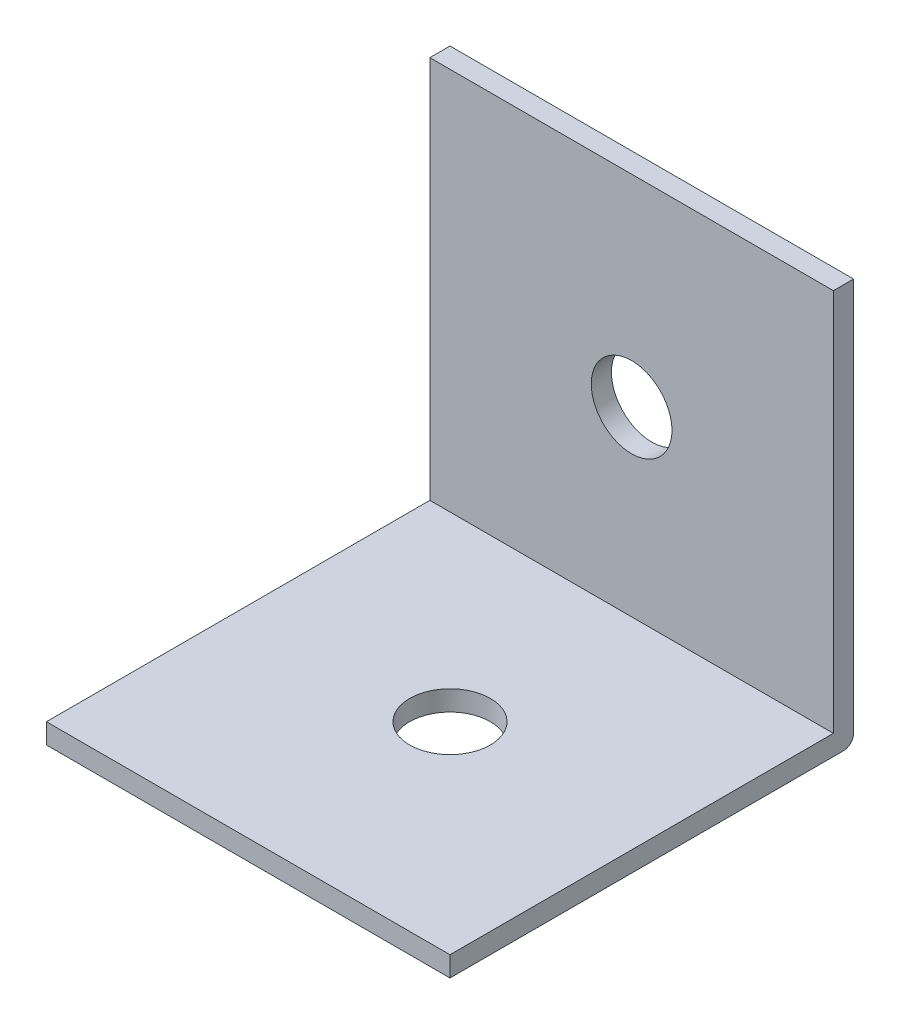
ISO-10303-21;
HEADER;
FILE_DESCRIPTION(('STEP AP214'),'2;1');
FILE_NAME('part.step','',(''),(''),'','','');
FILE_SCHEMA(('AUTOMOTIVE_DESIGN { 1 0 10303 214 1 1 1 1 }'));
ENDSEC;
DATA;
#1=APPLICATION_CONTEXT('core data for automotive mechanical design processes');
#2=APPLICATION_PROTOCOL_DEFINITION('international standard','automotive_design',2000,#1);
#3=PRODUCT_CONTEXT('',#1,'mechanical');
#4=PRODUCT('Part','Part','',(#3));
#5=PRODUCT_RELATED_PRODUCT_CATEGORY('part','',(#4));
#6=PRODUCT_DEFINITION_FORMATION('','',#4);
#7=PRODUCT_DEFINITION_CONTEXT('part definition',#1,'design');
#8=PRODUCT_DEFINITION('design','',#6,#7);
#9=PRODUCT_DEFINITION_SHAPE('','',#8);
#10=(LENGTH_UNIT() NAMED_UNIT(*) SI_UNIT(.MILLI.,.METRE.));
#11=(NAMED_UNIT(*) PLANE_ANGLE_UNIT() SI_UNIT($,.RADIAN.));
#12=(NAMED_UNIT(*) SI_UNIT($,.STERADIAN.) SOLID_ANGLE_UNIT());
#13=UNCERTAINTY_MEASURE_WITH_UNIT(LENGTH_MEASURE(1.E-05),#10,'distance_accuracy_value','');
#14=(GEOMETRIC_REPRESENTATION_CONTEXT(3) GLOBAL_UNCERTAINTY_ASSIGNED_CONTEXT((#13)) GLOBAL_UNIT_ASSIGNED_CONTEXT((#10,
#11,#12)) REPRESENTATION_CONTEXT('',''));
#15=CARTESIAN_POINT('',(0.,0.,0.));
#16=DIRECTION('',(0.,0.,1.));
#17=DIRECTION('',(1.,0.,0.));
#18=AXIS2_PLACEMENT_3D('',#15,#16,#17);
#19=CARTESIAN_POINT('',(10.,0.,0.));
#20=DIRECTION('',(0.,0.,1.));
#21=DIRECTION('',(1.,0.,0.));
#22=AXIS2_PLACEMENT_3D('',#19,#20,#21);
#23=PLANE('',#22);
#24=CARTESIAN_POINT('',(0.,10.,0.));
#25=DIRECTION('',(0.,0.,-1.));
#26=DIRECTION('',(-1.,0.,0.));
#27=AXIS2_PLACEMENT_3D('',#24,#25,#26);
#28=CIRCLE('',#27,2.);
#29=CARTESIAN_POINT('',(-2.,10.,0.));
#30=VERTEX_POINT('',#29);
#31=EDGE_CURVE('E156',#30,#30,#28,.T.);
#32=ORIENTED_EDGE('',*,*,#31,.F.);
#33=EDGE_LOOP('',(#32));
#34=FACE_BOUND('',#33,.T.);
#35=DIRECTION('',(0.,1.,0.));
#36=VECTOR('',#35,1.);
#37=CARTESIAN_POINT('',(10.,0.,0.));
#38=LINE('',#37,#36);
#39=CARTESIAN_POINT('',(10.,0.5,0.));
#40=VERTEX_POINT('',#39);
#41=CARTESIAN_POINT('',(10.,20.,0.));
#42=VERTEX_POINT('',#41);
#43=EDGE_CURVE('E130',#40,#42,#38,.T.);
#44=ORIENTED_EDGE('',*,*,#43,.F.);
#45=DIRECTION('',(-1.,0.,0.));
#46=VECTOR('',#45,1.);
#47=CARTESIAN_POINT('',(10.,0.5,0.));
#48=LINE('',#47,#46);
#49=CARTESIAN_POINT('',(-10.,0.5,0.));
#50=VERTEX_POINT('',#49);
#51=EDGE_CURVE('E145',#40,#50,#48,.T.);
#52=ORIENTED_EDGE('',*,*,#51,.T.);
#53=DIRECTION('',(0.,1.,0.));
#54=VECTOR('',#53,1.);
#55=CARTESIAN_POINT('',(-10.,0.,0.));
#56=LINE('',#55,#54);
#57=CARTESIAN_POINT('',(-10.,20.,0.));
#58=VERTEX_POINT('',#57);
#59=EDGE_CURVE('E133',#50,#58,#56,.T.);
#60=ORIENTED_EDGE('',*,*,#59,.T.);
#61=DIRECTION('',(-1.,0.,0.));
#62=VECTOR('',#61,1.);
#63=CARTESIAN_POINT('',(10.,20.,0.));
#64=LINE('',#63,#62);
#65=EDGE_CURVE('E140',#42,#58,#64,.T.);
#66=ORIENTED_EDGE('',*,*,#65,.F.);
#67=EDGE_LOOP('',(#44,#52,#60,#66));
#68=FACE_BOUND('',#67,.T.);
#69=ADVANCED_FACE('F39',(#34,#68),#23,.F.);
#70=CARTESIAN_POINT('',(10.,20.,0.));
#71=DIRECTION('',(0.,-1.,0.));
#72=DIRECTION('',(0.,0.,-1.));
#73=AXIS2_PLACEMENT_3D('',#70,#71,#72);
#74=PLANE('',#73);
#75=DIRECTION('',(0.,0.,1.));
#76=VECTOR('',#75,1.);
#77=CARTESIAN_POINT('',(-10.,20.,0.));
#78=LINE('',#77,#76);
#79=CARTESIAN_POINT('',(-10.,20.,1.));
#80=VERTEX_POINT('',#79);
#81=EDGE_CURVE('E126',#58,#80,#78,.T.);
#82=ORIENTED_EDGE('',*,*,#81,.T.);
#83=DIRECTION('',(1.,0.,0.));
#84=VECTOR('',#83,1.);
#85=CARTESIAN_POINT('',(-10.,20.,1.));
#86=LINE('',#85,#84);
#87=CARTESIAN_POINT('',(10.,20.,1.));
#88=VERTEX_POINT('',#87);
#89=EDGE_CURVE('E175',#80,#88,#86,.T.);
#90=ORIENTED_EDGE('',*,*,#89,.T.);
#91=DIRECTION('',(0.,0.,1.));
#92=VECTOR('',#91,1.);
#93=CARTESIAN_POINT('',(10.,20.,0.));
#94=LINE('',#93,#92);
#95=EDGE_CURVE('E183',#42,#88,#94,.T.);
#96=ORIENTED_EDGE('',*,*,#95,.F.);
#97=ORIENTED_EDGE('',*,*,#65,.T.);
#98=EDGE_LOOP('',(#82,#90,#96,#97));
#99=FACE_BOUND('',#98,.T.);
#100=ADVANCED_FACE('F198',(#99),#74,.F.);
#101=CARTESIAN_POINT('',(10.,0.,20.));
#102=DIRECTION('',(0.,0.,-1.));
#103=DIRECTION('',(-1.,0.,0.));
#104=AXIS2_PLACEMENT_3D('',#101,#102,#103);
#105=PLANE('',#104);
#106=DIRECTION('',(0.,-1.,0.));
#107=VECTOR('',#106,1.);
#108=CARTESIAN_POINT('',(10.,0.,20.));
#109=LINE('',#108,#107);
#110=CARTESIAN_POINT('',(10.,1.,20.));
#111=VERTEX_POINT('',#110);
#112=CARTESIAN_POINT('',(10.,0.,20.));
#113=VERTEX_POINT('',#112);
#114=EDGE_CURVE('E120',#111,#113,#109,.T.);
#115=ORIENTED_EDGE('',*,*,#114,.F.);
#116=DIRECTION('',(1.,0.,0.));
#117=VECTOR('',#116,1.);
#118=CARTESIAN_POINT('',(-10.,1.,20.));
#119=LINE('',#118,#117);
#120=CARTESIAN_POINT('',(-10.,1.,20.));
#121=VERTEX_POINT('',#120);
#122=EDGE_CURVE('E105',#121,#111,#119,.T.);
#123=ORIENTED_EDGE('',*,*,#122,.F.);
#124=DIRECTION('',(0.,-1.,0.));
#125=VECTOR('',#124,1.);
#126=CARTESIAN_POINT('',(-10.,0.,20.));
#127=LINE('',#126,#125);
#128=CARTESIAN_POINT('',(-10.,0.,20.));
#129=VERTEX_POINT('',#128);
#130=EDGE_CURVE('E118',#121,#129,#127,.T.);
#131=ORIENTED_EDGE('',*,*,#130,.T.);
#132=DIRECTION('',(-1.,0.,0.));
#133=VECTOR('',#132,1.);
#134=CARTESIAN_POINT('',(10.,0.,20.));
#135=LINE('',#134,#133);
#136=EDGE_CURVE('E137',#113,#129,#135,.T.);
#137=ORIENTED_EDGE('',*,*,#136,.F.);
#138=EDGE_LOOP('',(#115,#123,#131,#137));
#139=FACE_BOUND('',#138,.T.);
#140=ADVANCED_FACE('F116',(#139),#105,.F.);
#141=CARTESIAN_POINT('',(10.,0.,0.));
#142=DIRECTION('',(0.,1.,0.));
#143=DIRECTION('',(0.,0.,1.));
#144=AXIS2_PLACEMENT_3D('',#141,#142,#143);
#145=PLANE('',#144);
#146=CARTESIAN_POINT('',(0.,0.,10.));
#147=DIRECTION('',(0.,-1.,0.));
#148=DIRECTION('',(0.,0.,-1.));
#149=AXIS2_PLACEMENT_3D('',#146,#147,#148);
#150=CIRCLE('',#149,2.);
#151=CARTESIAN_POINT('',(0.,0.,8.));
#152=VERTEX_POINT('',#151);
#153=EDGE_CURVE('E168',#152,#152,#150,.T.);
#154=ORIENTED_EDGE('',*,*,#153,.F.);
#155=EDGE_LOOP('',(#154));
#156=FACE_BOUND('',#155,.T.);
#157=DIRECTION('',(0.,0.,-1.));
#158=VECTOR('',#157,1.);
#159=CARTESIAN_POINT('',(-10.,0.,0.));
#160=LINE('',#159,#158);
#161=CARTESIAN_POINT('',(-10.,0.,0.5));
#162=VERTEX_POINT('',#161);
#163=EDGE_CURVE('E124',#129,#162,#160,.T.);
#164=ORIENTED_EDGE('',*,*,#163,.T.);
#165=DIRECTION('',(-1.,0.,0.));
#166=VECTOR('',#165,1.);
#167=CARTESIAN_POINT('',(10.,0.,0.5));
#168=LINE('',#167,#166);
#169=CARTESIAN_POINT('',(10.,0.,0.5));
#170=VERTEX_POINT('',#169);
#171=EDGE_CURVE('E49',#162,#170,#168,.F.);
#172=ORIENTED_EDGE('',*,*,#171,.T.);
#173=DIRECTION('',(0.,0.,-1.));
#174=VECTOR('',#173,1.);
#175=CARTESIAN_POINT('',(10.,0.,0.));
#176=LINE('',#175,#174);
#177=EDGE_CURVE('E141',#113,#170,#176,.T.);
#178=ORIENTED_EDGE('',*,*,#177,.F.);
#179=ORIENTED_EDGE('',*,*,#136,.T.);
#180=EDGE_LOOP('',(#164,#172,#178,#179));
#181=FACE_BOUND('',#180,.T.);
#182=ADVANCED_FACE('F224',(#156,#181),#145,.F.);
#183=CARTESIAN_POINT('',(10.,0.,0.));
#184=DIRECTION('',(1.,0.,0.));
#185=DIRECTION('',(0.,0.,-1.));
#186=AXIS2_PLACEMENT_3D('',#183,#184,#185);
#187=PLANE('',#186);
#188=ORIENTED_EDGE('',*,*,#177,.T.);
#189=CARTESIAN_POINT('',(10.,0.5,0.5));
#190=DIRECTION('',(1.,0.,0.));
#191=DIRECTION('',(0.,0.,-1.));
#192=AXIS2_PLACEMENT_3D('',#189,#190,#191);
#193=CIRCLE('',#192,0.5);
#194=EDGE_CURVE('E11',#170,#40,#193,.T.);
#195=ORIENTED_EDGE('',*,*,#194,.T.);
#196=ORIENTED_EDGE('',*,*,#43,.T.);
#197=ORIENTED_EDGE('',*,*,#95,.T.);
#198=DIRECTION('',(0.,1.,0.));
#199=VECTOR('',#198,1.);
#200=CARTESIAN_POINT('',(10.,20.,1.));
#201=LINE('',#200,#199);
#202=CARTESIAN_POINT('',(10.,1.,1.));
#203=VERTEX_POINT('',#202);
#204=EDGE_CURVE('E112',#203,#88,#201,.T.);
#205=ORIENTED_EDGE('',*,*,#204,.F.);
#206=DIRECTION('',(0.,0.,-1.));
#207=VECTOR('',#206,1.);
#208=CARTESIAN_POINT('',(10.,1.,20.));
#209=LINE('',#208,#207);
#210=EDGE_CURVE('E155',#111,#203,#209,.T.);
#211=ORIENTED_EDGE('',*,*,#210,.F.);
#212=ORIENTED_EDGE('',*,*,#114,.T.);
#213=EDGE_LOOP('',(#188,#195,#196,#197,#205,#211,#212));
#214=FACE_BOUND('',#213,.T.);
#215=ADVANCED_FACE('F201',(#214),#187,.T.);
#216=CARTESIAN_POINT('',(-10.,0.,0.));
#217=DIRECTION('',(1.,0.,0.));
#218=DIRECTION('',(0.,0.,-1.));
#219=AXIS2_PLACEMENT_3D('',#216,#217,#218);
#220=PLANE('',#219);
#221=ORIENTED_EDGE('',*,*,#59,.F.);
#222=CARTESIAN_POINT('',(-10.,0.5,0.5));
#223=DIRECTION('',(1.,0.,0.));
#224=DIRECTION('',(0.,0.,-1.));
#225=AXIS2_PLACEMENT_3D('',#222,#223,#224);
#226=CIRCLE('',#225,0.5);
#227=EDGE_CURVE('E64',#50,#162,#226,.F.);
#228=ORIENTED_EDGE('',*,*,#227,.T.);
#229=ORIENTED_EDGE('',*,*,#163,.F.);
#230=ORIENTED_EDGE('',*,*,#130,.F.);
#231=DIRECTION('',(0.,0.,-1.));
#232=VECTOR('',#231,1.);
#233=CARTESIAN_POINT('',(-10.,1.,20.));
#234=LINE('',#233,#232);
#235=CARTESIAN_POINT('',(-10.,1.,1.));
#236=VERTEX_POINT('',#235);
#237=EDGE_CURVE('E101',#121,#236,#234,.T.);
#238=ORIENTED_EDGE('',*,*,#237,.T.);
#239=DIRECTION('',(0.,1.,0.));
#240=VECTOR('',#239,1.);
#241=CARTESIAN_POINT('',(-10.,20.,1.));
#242=LINE('',#241,#240);
#243=EDGE_CURVE('E111',#236,#80,#242,.T.);
#244=ORIENTED_EDGE('',*,*,#243,.T.);
#245=ORIENTED_EDGE('',*,*,#81,.F.);
#246=EDGE_LOOP('',(#221,#228,#229,#230,#238,#244,#245));
#247=FACE_BOUND('',#246,.T.);
#248=ADVANCED_FACE('F123',(#247),#220,.F.);
#249=CARTESIAN_POINT('',(-10.,20.,1.));
#250=DIRECTION('',(0.,0.,-1.));
#251=DIRECTION('',(-1.,0.,0.));
#252=AXIS2_PLACEMENT_3D('',#249,#250,#251);
#253=PLANE('',#252);
#254=CARTESIAN_POINT('',(0.,10.,1.));
#255=DIRECTION('',(0.,0.,-1.));
#256=DIRECTION('',(-1.,0.,0.));
#257=AXIS2_PLACEMENT_3D('',#254,#255,#256);
#258=CIRCLE('',#257,2.);
#259=CARTESIAN_POINT('',(-2.,10.,1.));
#260=VERTEX_POINT('',#259);
#261=EDGE_CURVE('E152',#260,#260,#258,.T.);
#262=ORIENTED_EDGE('',*,*,#261,.T.);
#263=EDGE_LOOP('',(#262));
#264=FACE_BOUND('',#263,.T.);
#265=ORIENTED_EDGE('',*,*,#204,.T.);
#266=ORIENTED_EDGE('',*,*,#89,.F.);
#267=ORIENTED_EDGE('',*,*,#243,.F.);
#268=DIRECTION('',(1.,0.,0.));
#269=VECTOR('',#268,1.);
#270=CARTESIAN_POINT('',(-10.,1.,1.));
#271=LINE('',#270,#269);
#272=EDGE_CURVE('E107',#236,#203,#271,.T.);
#273=ORIENTED_EDGE('',*,*,#272,.T.);
#274=EDGE_LOOP('',(#265,#266,#267,#273));
#275=FACE_BOUND('',#274,.T.);
#276=ADVANCED_FACE('F212',(#264,#275),#253,.F.);
#277=CARTESIAN_POINT('',(-10.,1.,20.));
#278=DIRECTION('',(0.,-1.,0.));
#279=DIRECTION('',(0.,0.,-1.));
#280=AXIS2_PLACEMENT_3D('',#277,#278,#279);
#281=PLANE('',#280);
#282=CARTESIAN_POINT('',(0.,1.,10.));
#283=DIRECTION('',(0.,-1.,0.));
#284=DIRECTION('',(0.,0.,-1.));
#285=AXIS2_PLACEMENT_3D('',#282,#283,#284);
#286=CIRCLE('',#285,2.);
#287=CARTESIAN_POINT('',(0.,1.,8.));
#288=VERTEX_POINT('',#287);
#289=EDGE_CURVE('E43',#288,#288,#286,.T.);
#290=ORIENTED_EDGE('',*,*,#289,.T.);
#291=EDGE_LOOP('',(#290));
#292=FACE_BOUND('',#291,.T.);
#293=ORIENTED_EDGE('',*,*,#210,.T.);
#294=ORIENTED_EDGE('',*,*,#272,.F.);
#295=ORIENTED_EDGE('',*,*,#237,.F.);
#296=ORIENTED_EDGE('',*,*,#122,.T.);
#297=EDGE_LOOP('',(#293,#294,#295,#296));
#298=FACE_BOUND('',#297,.T.);
#299=ADVANCED_FACE('F104',(#292,#298),#281,.F.);
#300=CARTESIAN_POINT('',(10.,0.5,0.5));
#301=DIRECTION('',(-1.,0.,0.));
#302=DIRECTION('',(0.,0.,1.));
#303=AXIS2_PLACEMENT_3D('',#300,#301,#302);
#304=CYLINDRICAL_SURFACE('',#303,0.5);
#305=ORIENTED_EDGE('',*,*,#194,.F.);
#306=ORIENTED_EDGE('',*,*,#171,.F.);
#307=ORIENTED_EDGE('',*,*,#227,.F.);
#308=ORIENTED_EDGE('',*,*,#51,.F.);
#309=EDGE_LOOP('',(#305,#306,#307,#308));
#310=FACE_BOUND('',#309,.T.);
#311=ADVANCED_FACE('F41',(#310),#304,.T.);
#312=CARTESIAN_POINT('',(0.,10.,2.));
#313=DIRECTION('',(0.,0.,-1.));
#314=DIRECTION('',(-1.,0.,0.));
#315=AXIS2_PLACEMENT_3D('',#312,#313,#314);
#316=CYLINDRICAL_SURFACE('',#315,2.);
#317=ORIENTED_EDGE('',*,*,#31,.T.);
#318=EDGE_LOOP('',(#317));
#319=FACE_BOUND('',#318,.T.);
#320=ORIENTED_EDGE('',*,*,#261,.F.);
#321=EDGE_LOOP('',(#320));
#322=FACE_BOUND('',#321,.T.);
#323=ADVANCED_FACE('F205',(#319,#322),#316,.F.);
#324=CARTESIAN_POINT('',(0.,2.,10.));
#325=DIRECTION('',(0.,-1.,0.));
#326=DIRECTION('',(0.,0.,-1.));
#327=AXIS2_PLACEMENT_3D('',#324,#325,#326);
#328=CYLINDRICAL_SURFACE('',#327,2.);
#329=ORIENTED_EDGE('',*,*,#153,.T.);
#330=EDGE_LOOP('',(#329));
#331=FACE_BOUND('',#330,.T.);
#332=ORIENTED_EDGE('',*,*,#289,.F.);
#333=EDGE_LOOP('',(#332));
#334=FACE_BOUND('',#333,.T.);
#335=ADVANCED_FACE('F210',(#331,#334),#328,.F.);
#336=CLOSED_SHELL('',(#69,#100,#140,#182,#215,#248,#276,#299,#311,#323,#335));
#337=MANIFOLD_SOLID_BREP('B2',#336);
#338=ADVANCED_BREP_SHAPE_REPRESENTATION('',(#18,#337),#14);
#339=SHAPE_DEFINITION_REPRESENTATION(#9,#338);
ENDSEC;
END-ISO-10303-21;
